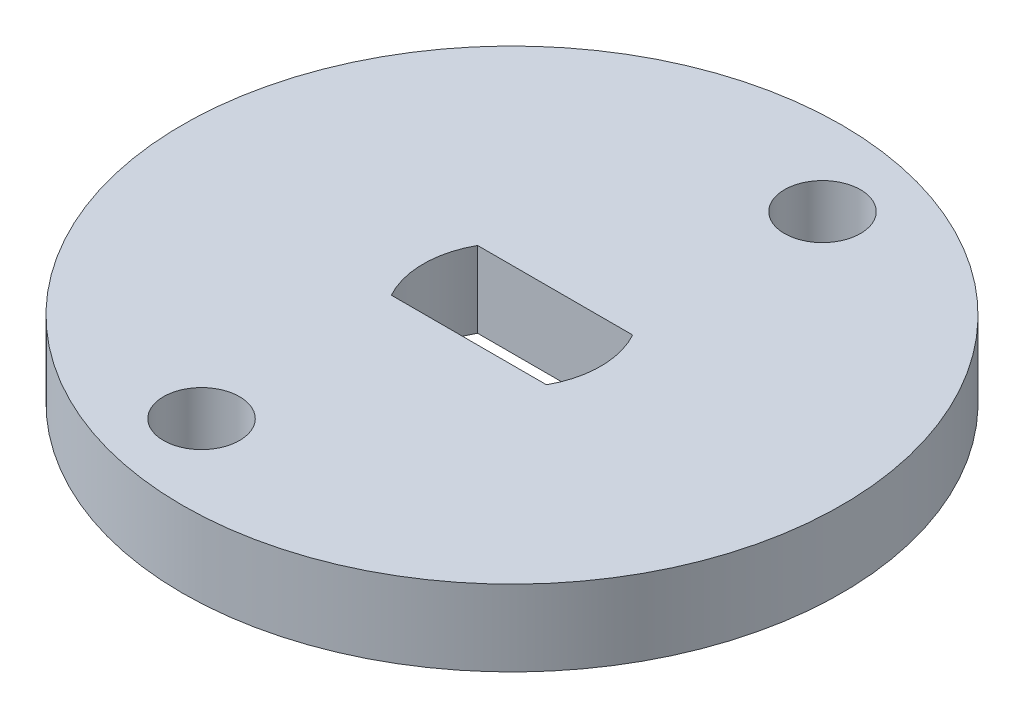
ISO-10303-21;
HEADER;
FILE_DESCRIPTION(('STEP AP214'),'2;1');
FILE_NAME('part.step','',(''),(''),'','','');
FILE_SCHEMA(('AUTOMOTIVE_DESIGN { 1 0 10303 214 1 1 1 1 }'));
ENDSEC;
DATA;
#1=APPLICATION_CONTEXT('core data for automotive mechanical design processes');
#2=APPLICATION_PROTOCOL_DEFINITION('international standard','automotive_design',2000,#1);
#3=PRODUCT_CONTEXT('',#1,'mechanical');
#4=PRODUCT('Part','Part','',(#3));
#5=PRODUCT_RELATED_PRODUCT_CATEGORY('part','',(#4));
#6=PRODUCT_DEFINITION_FORMATION('','',#4);
#7=PRODUCT_DEFINITION_CONTEXT('part definition',#1,'design');
#8=PRODUCT_DEFINITION('design','',#6,#7);
#9=PRODUCT_DEFINITION_SHAPE('','',#8);
#10=(LENGTH_UNIT() NAMED_UNIT(*) SI_UNIT(.MILLI.,.METRE.));
#11=(NAMED_UNIT(*) PLANE_ANGLE_UNIT() SI_UNIT($,.RADIAN.));
#12=(NAMED_UNIT(*) SI_UNIT($,.STERADIAN.) SOLID_ANGLE_UNIT());
#13=UNCERTAINTY_MEASURE_WITH_UNIT(LENGTH_MEASURE(1.E-05),#10,'distance_accuracy_value','');
#14=(GEOMETRIC_REPRESENTATION_CONTEXT(3) GLOBAL_UNCERTAINTY_ASSIGNED_CONTEXT((#13)) GLOBAL_UNIT_ASSIGNED_CONTEXT((#10,
#11,#12)) REPRESENTATION_CONTEXT('',''));
#15=CARTESIAN_POINT('',(0.,0.,0.));
#16=DIRECTION('',(0.,0.,1.));
#17=DIRECTION('',(1.,0.,0.));
#18=AXIS2_PLACEMENT_3D('',#15,#16,#17);
#19=CARTESIAN_POINT('',(0.,3.,0.));
#20=DIRECTION('',(0.,1.,0.));
#21=DIRECTION('',(0.,0.,1.));
#22=AXIS2_PLACEMENT_3D('',#19,#20,#21);
#23=PLANE('',#22);
#24=CARTESIAN_POINT('',(-2.58819045102518,3.,9.6592582628907));
#25=DIRECTION('',(0.,1.,0.));
#26=DIRECTION('',(0.,0.,1.));
#27=AXIS2_PLACEMENT_3D('',#24,#25,#26);
#28=CIRCLE('',#27,1.5);
#29=CARTESIAN_POINT('',(-2.58819045102518,3.,11.1592582628907));
#30=VERTEX_POINT('',#29);
#31=EDGE_CURVE('E103',#30,#30,#28,.T.);
#32=ORIENTED_EDGE('',*,*,#31,.F.);
#33=EDGE_LOOP('',(#32));
#34=FACE_BOUND('',#33,.T.);
#35=CARTESIAN_POINT('',(0.,3.,0.));
#36=DIRECTION('',(0.,1.,0.));
#37=DIRECTION('',(0.,0.,1.));
#38=AXIS2_PLACEMENT_3D('',#35,#36,#37);
#39=CIRCLE('',#38,13.);
#40=CARTESIAN_POINT('',(0.,3.,13.));
#41=VERTEX_POINT('',#40);
#42=EDGE_CURVE('E11',#41,#41,#39,.T.);
#43=ORIENTED_EDGE('',*,*,#42,.T.);
#44=EDGE_LOOP('',(#43));
#45=FACE_BOUND('',#44,.T.);
#46=DIRECTION('',(1.,0.,0.));
#47=VECTOR('',#46,1.);
#48=CARTESIAN_POINT('',(3.05941170815567,3.,1.7));
#49=LINE('',#48,#47);
#50=CARTESIAN_POINT('',(-3.05941170815567,3.,1.7));
#51=VERTEX_POINT('',#50);
#52=CARTESIAN_POINT('',(3.05941170815567,3.,1.7));
#53=VERTEX_POINT('',#52);
#54=EDGE_CURVE('E83',#51,#53,#49,.T.);
#55=ORIENTED_EDGE('',*,*,#54,.F.);
#56=CARTESIAN_POINT('',(0.,3.,0.));
#57=DIRECTION('',(0.,1.,0.));
#58=DIRECTION('',(0.,0.,1.));
#59=AXIS2_PLACEMENT_3D('',#56,#57,#58);
#60=CIRCLE('',#59,3.5);
#61=CARTESIAN_POINT('',(-3.05941170815567,3.,-1.7));
#62=VERTEX_POINT('',#61);
#63=EDGE_CURVE('E75',#62,#51,#60,.T.);
#64=ORIENTED_EDGE('',*,*,#63,.F.);
#65=DIRECTION('',(-1.,0.,0.));
#66=VECTOR('',#65,1.);
#67=CARTESIAN_POINT('',(-3.05941170815567,3.,-1.7));
#68=LINE('',#67,#66);
#69=CARTESIAN_POINT('',(3.05941170815567,3.,-1.7));
#70=VERTEX_POINT('',#69);
#71=EDGE_CURVE('E97',#70,#62,#68,.T.);
#72=ORIENTED_EDGE('',*,*,#71,.F.);
#73=CARTESIAN_POINT('',(0.,3.,0.));
#74=DIRECTION('',(0.,1.,0.));
#75=DIRECTION('',(0.,0.,1.));
#76=AXIS2_PLACEMENT_3D('',#73,#74,#75);
#77=CIRCLE('',#76,3.5);
#78=EDGE_CURVE('E95',#53,#70,#77,.T.);
#79=ORIENTED_EDGE('',*,*,#78,.F.);
#80=EDGE_LOOP('',(#55,#64,#72,#79));
#81=FACE_BOUND('',#80,.T.);
#82=CARTESIAN_POINT('',(2.58819045102517,3.,-9.6592582628907));
#83=DIRECTION('',(0.,1.,0.));
#84=DIRECTION('',(0.,0.,1.));
#85=AXIS2_PLACEMENT_3D('',#82,#83,#84);
#86=CIRCLE('',#85,1.5);
#87=CARTESIAN_POINT('',(2.58819045102517,3.,-8.1592582628907));
#88=VERTEX_POINT('',#87);
#89=EDGE_CURVE('E178',#88,#88,#86,.T.);
#90=ORIENTED_EDGE('',*,*,#89,.F.);
#91=EDGE_LOOP('',(#90));
#92=FACE_BOUND('',#91,.T.);
#93=ADVANCED_FACE('F34',(#34,#45,#81,#92),#23,.T.);
#94=CARTESIAN_POINT('',(0.,0.,0.));
#95=DIRECTION('',(0.,1.,0.));
#96=DIRECTION('',(0.,0.,1.));
#97=AXIS2_PLACEMENT_3D('',#94,#95,#96);
#98=PLANE('',#97);
#99=CARTESIAN_POINT('',(0.,0.,0.));
#100=DIRECTION('',(0.,1.,0.));
#101=DIRECTION('',(0.,0.,1.));
#102=AXIS2_PLACEMENT_3D('',#99,#100,#101);
#103=CIRCLE('',#102,13.);
#104=CARTESIAN_POINT('',(0.,0.,13.));
#105=VERTEX_POINT('',#104);
#106=EDGE_CURVE('E38',#105,#105,#103,.T.);
#107=ORIENTED_EDGE('',*,*,#106,.F.);
#108=EDGE_LOOP('',(#107));
#109=FACE_BOUND('',#108,.T.);
#110=CARTESIAN_POINT('',(0.,0.,0.));
#111=DIRECTION('',(0.,1.,0.));
#112=DIRECTION('',(0.,0.,1.));
#113=AXIS2_PLACEMENT_3D('',#110,#111,#112);
#114=CIRCLE('',#113,3.5);
#115=CARTESIAN_POINT('',(-3.05941170815567,0.,-1.7));
#116=VERTEX_POINT('',#115);
#117=CARTESIAN_POINT('',(-3.05941170815567,0.,1.7));
#118=VERTEX_POINT('',#117);
#119=EDGE_CURVE('E57',#116,#118,#114,.T.);
#120=ORIENTED_EDGE('',*,*,#119,.T.);
#121=DIRECTION('',(1.,0.,0.));
#122=VECTOR('',#121,1.);
#123=CARTESIAN_POINT('',(3.05941170815567,0.,1.7));
#124=LINE('',#123,#122);
#125=CARTESIAN_POINT('',(3.05941170815567,0.,1.7));
#126=VERTEX_POINT('',#125);
#127=EDGE_CURVE('E90',#118,#126,#124,.T.);
#128=ORIENTED_EDGE('',*,*,#127,.T.);
#129=CARTESIAN_POINT('',(0.,0.,0.));
#130=DIRECTION('',(0.,1.,0.));
#131=DIRECTION('',(0.,0.,1.));
#132=AXIS2_PLACEMENT_3D('',#129,#130,#131);
#133=CIRCLE('',#132,3.5);
#134=CARTESIAN_POINT('',(3.05941170815567,0.,-1.7));
#135=VERTEX_POINT('',#134);
#136=EDGE_CURVE('E105',#126,#135,#133,.T.);
#137=ORIENTED_EDGE('',*,*,#136,.T.);
#138=DIRECTION('',(-1.,0.,0.));
#139=VECTOR('',#138,1.);
#140=CARTESIAN_POINT('',(-3.05941170815567,0.,-1.7));
#141=LINE('',#140,#139);
#142=EDGE_CURVE('E84',#135,#116,#141,.T.);
#143=ORIENTED_EDGE('',*,*,#142,.T.);
#144=EDGE_LOOP('',(#120,#128,#137,#143));
#145=FACE_BOUND('',#144,.T.);
#146=CARTESIAN_POINT('',(-2.58819045102518,0.,9.6592582628907));
#147=DIRECTION('',(0.,1.,0.));
#148=DIRECTION('',(0.,0.,1.));
#149=AXIS2_PLACEMENT_3D('',#146,#147,#148);
#150=CIRCLE('',#149,1.5);
#151=CARTESIAN_POINT('',(-2.58819045102518,0.,11.1592582628907));
#152=VERTEX_POINT('',#151);
#153=EDGE_CURVE('E184',#152,#152,#150,.T.);
#154=ORIENTED_EDGE('',*,*,#153,.T.);
#155=EDGE_LOOP('',(#154));
#156=FACE_BOUND('',#155,.T.);
#157=CARTESIAN_POINT('',(2.58819045102517,0.,-9.6592582628907));
#158=DIRECTION('',(0.,1.,0.));
#159=DIRECTION('',(0.,0.,1.));
#160=AXIS2_PLACEMENT_3D('',#157,#158,#159);
#161=CIRCLE('',#160,1.5);
#162=CARTESIAN_POINT('',(2.58819045102517,0.,-8.1592582628907));
#163=VERTEX_POINT('',#162);
#164=EDGE_CURVE('E181',#163,#163,#161,.T.);
#165=ORIENTED_EDGE('',*,*,#164,.T.);
#166=EDGE_LOOP('',(#165));
#167=FACE_BOUND('',#166,.T.);
#168=ADVANCED_FACE('F116',(#109,#145,#156,#167),#98,.F.);
#169=CARTESIAN_POINT('',(0.,3.,0.));
#170=DIRECTION('',(0.,-1.,0.));
#171=DIRECTION('',(0.,0.,-1.));
#172=AXIS2_PLACEMENT_3D('',#169,#170,#171);
#173=CYLINDRICAL_SURFACE('',#172,13.);
#174=ORIENTED_EDGE('',*,*,#42,.F.);
#175=EDGE_LOOP('',(#174));
#176=FACE_BOUND('',#175,.T.);
#177=ORIENTED_EDGE('',*,*,#106,.T.);
#178=EDGE_LOOP('',(#177));
#179=FACE_BOUND('',#178,.T.);
#180=ADVANCED_FACE('F36',(#176,#179),#173,.T.);
#181=CARTESIAN_POINT('',(0.,3.,0.));
#182=DIRECTION('',(0.,-1.,0.));
#183=DIRECTION('',(0.,0.,-1.));
#184=AXIS2_PLACEMENT_3D('',#181,#182,#183);
#185=CYLINDRICAL_SURFACE('',#184,3.5);
#186=ORIENTED_EDGE('',*,*,#119,.F.);
#187=DIRECTION('',(0.,-1.,0.));
#188=VECTOR('',#187,1.);
#189=CARTESIAN_POINT('',(-3.05941170815567,3.,-1.7));
#190=LINE('',#189,#188);
#191=EDGE_CURVE('E79',#62,#116,#190,.T.);
#192=ORIENTED_EDGE('',*,*,#191,.F.);
#193=ORIENTED_EDGE('',*,*,#63,.T.);
#194=DIRECTION('',(0.,-1.,0.));
#195=VECTOR('',#194,1.);
#196=CARTESIAN_POINT('',(-3.05941170815567,3.,1.7));
#197=LINE('',#196,#195);
#198=EDGE_CURVE('E78',#51,#118,#197,.T.);
#199=ORIENTED_EDGE('',*,*,#198,.T.);
#200=EDGE_LOOP('',(#186,#192,#193,#199));
#201=FACE_BOUND('',#200,.T.);
#202=ADVANCED_FACE('F77',(#201),#185,.F.);
#203=CARTESIAN_POINT('',(3.05941170815567,3.,1.7));
#204=DIRECTION('',(0.,0.,-1.));
#205=DIRECTION('',(-1.,0.,0.));
#206=AXIS2_PLACEMENT_3D('',#203,#204,#205);
#207=PLANE('',#206);
#208=ORIENTED_EDGE('',*,*,#127,.F.);
#209=ORIENTED_EDGE('',*,*,#198,.F.);
#210=ORIENTED_EDGE('',*,*,#54,.T.);
#211=DIRECTION('',(0.,-1.,0.));
#212=VECTOR('',#211,1.);
#213=CARTESIAN_POINT('',(3.05941170815567,3.,1.7));
#214=LINE('',#213,#212);
#215=EDGE_CURVE('E91',#53,#126,#214,.T.);
#216=ORIENTED_EDGE('',*,*,#215,.T.);
#217=EDGE_LOOP('',(#208,#209,#210,#216));
#218=FACE_BOUND('',#217,.T.);
#219=ADVANCED_FACE('F87',(#218),#207,.T.);
#220=CARTESIAN_POINT('',(0.,3.,0.));
#221=DIRECTION('',(0.,-1.,0.));
#222=DIRECTION('',(0.,0.,-1.));
#223=AXIS2_PLACEMENT_3D('',#220,#221,#222);
#224=CYLINDRICAL_SURFACE('',#223,3.5);
#225=ORIENTED_EDGE('',*,*,#136,.F.);
#226=ORIENTED_EDGE('',*,*,#215,.F.);
#227=ORIENTED_EDGE('',*,*,#78,.T.);
#228=DIRECTION('',(0.,-1.,0.));
#229=VECTOR('',#228,1.);
#230=CARTESIAN_POINT('',(3.05941170815567,3.,-1.7));
#231=LINE('',#230,#229);
#232=EDGE_CURVE('E49',#70,#135,#231,.T.);
#233=ORIENTED_EDGE('',*,*,#232,.T.);
#234=EDGE_LOOP('',(#225,#226,#227,#233));
#235=FACE_BOUND('',#234,.T.);
#236=ADVANCED_FACE('F114',(#235),#224,.F.);
#237=CARTESIAN_POINT('',(-3.05941170815567,3.,-1.7));
#238=DIRECTION('',(0.,0.,1.));
#239=DIRECTION('',(1.,0.,0.));
#240=AXIS2_PLACEMENT_3D('',#237,#238,#239);
#241=PLANE('',#240);
#242=ORIENTED_EDGE('',*,*,#142,.F.);
#243=ORIENTED_EDGE('',*,*,#232,.F.);
#244=ORIENTED_EDGE('',*,*,#71,.T.);
#245=ORIENTED_EDGE('',*,*,#191,.T.);
#246=EDGE_LOOP('',(#242,#243,#244,#245));
#247=FACE_BOUND('',#246,.T.);
#248=ADVANCED_FACE('F118',(#247),#241,.T.);
#249=CARTESIAN_POINT('',(-2.58819045102518,3.,9.6592582628907));
#250=DIRECTION('',(0.,-1.,0.));
#251=DIRECTION('',(0.,0.,-1.));
#252=AXIS2_PLACEMENT_3D('',#249,#250,#251);
#253=CYLINDRICAL_SURFACE('',#252,1.5);
#254=ORIENTED_EDGE('',*,*,#31,.T.);
#255=EDGE_LOOP('',(#254));
#256=FACE_BOUND('',#255,.T.);
#257=ORIENTED_EDGE('',*,*,#153,.F.);
#258=EDGE_LOOP('',(#257));
#259=FACE_BOUND('',#258,.T.);
#260=ADVANCED_FACE('F120',(#256,#259),#253,.F.);
#261=CARTESIAN_POINT('',(2.58819045102517,3.,-9.6592582628907));
#262=DIRECTION('',(0.,-1.,0.));
#263=DIRECTION('',(0.,0.,-1.));
#264=AXIS2_PLACEMENT_3D('',#261,#262,#263);
#265=CYLINDRICAL_SURFACE('',#264,1.5);
#266=ORIENTED_EDGE('',*,*,#89,.T.);
#267=EDGE_LOOP('',(#266));
#268=FACE_BOUND('',#267,.T.);
#269=ORIENTED_EDGE('',*,*,#164,.F.);
#270=EDGE_LOOP('',(#269));
#271=FACE_BOUND('',#270,.T.);
#272=ADVANCED_FACE('F126',(#268,#271),#265,.F.);
#273=CLOSED_SHELL('',(#93,#168,#180,#202,#219,#236,#248,#260,#272));
#274=MANIFOLD_SOLID_BREP('B2',#273);
#275=ADVANCED_BREP_SHAPE_REPRESENTATION('',(#18,#274),#14);
#276=SHAPE_DEFINITION_REPRESENTATION(#9,#275);
ENDSEC;
END-ISO-10303-21;
